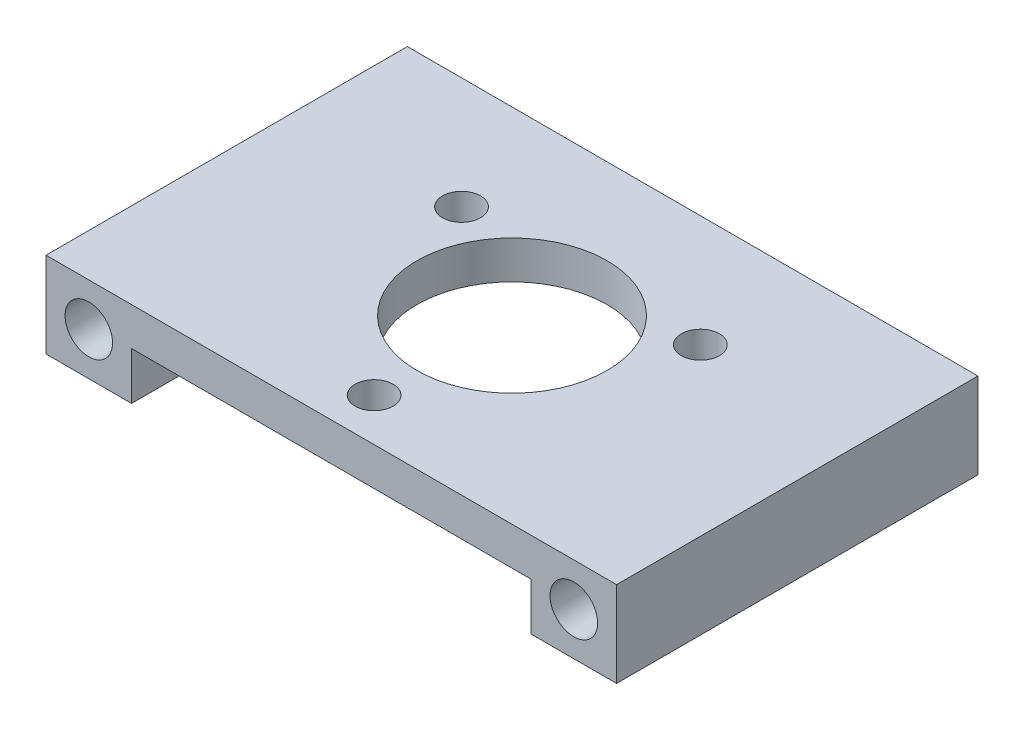
ISO-10303-21;
HEADER;
FILE_DESCRIPTION(('STEP AP214'),'2;1');
FILE_NAME('part.step','',(''),(''),'','','');
FILE_SCHEMA(('AUTOMOTIVE_DESIGN { 1 0 10303 214 1 1 1 1 }'));
ENDSEC;
DATA;
#1=APPLICATION_CONTEXT('core data for automotive mechanical design processes');
#2=APPLICATION_PROTOCOL_DEFINITION('international standard','automotive_design',2000,#1);
#3=PRODUCT_CONTEXT('',#1,'mechanical');
#4=PRODUCT('Part','Part','',(#3));
#5=PRODUCT_RELATED_PRODUCT_CATEGORY('part','',(#4));
#6=PRODUCT_DEFINITION_FORMATION('','',#4);
#7=PRODUCT_DEFINITION_CONTEXT('part definition',#1,'design');
#8=PRODUCT_DEFINITION('design','',#6,#7);
#9=PRODUCT_DEFINITION_SHAPE('','',#8);
#10=(LENGTH_UNIT() NAMED_UNIT(*) SI_UNIT(.MILLI.,.METRE.));
#11=(NAMED_UNIT(*) PLANE_ANGLE_UNIT() SI_UNIT($,.RADIAN.));
#12=(NAMED_UNIT(*) SI_UNIT($,.STERADIAN.) SOLID_ANGLE_UNIT());
#13=UNCERTAINTY_MEASURE_WITH_UNIT(LENGTH_MEASURE(1.E-05),#10,'distance_accuracy_value','');
#14=(GEOMETRIC_REPRESENTATION_CONTEXT(3) GLOBAL_UNCERTAINTY_ASSIGNED_CONTEXT((#13)) GLOBAL_UNIT_ASSIGNED_CONTEXT((#10,
#11,#12)) REPRESENTATION_CONTEXT('',''));
#15=CARTESIAN_POINT('',(0.,0.,0.));
#16=DIRECTION('',(0.,0.,1.));
#17=DIRECTION('',(1.,0.,0.));
#18=AXIS2_PLACEMENT_3D('',#15,#16,#17);
#19=CARTESIAN_POINT('',(0.,0.,38.));
#20=DIRECTION('',(0.,0.,-1.));
#21=DIRECTION('',(-1.,0.,0.));
#22=AXIS2_PLACEMENT_3D('',#19,#20,#21);
#23=PLANE('',#22);
#24=DIRECTION('',(-1.,0.,0.));
#25=VECTOR('',#24,1.);
#26=CARTESIAN_POINT('',(-30.,0.,38.));
#27=LINE('',#26,#25);
#28=CARTESIAN_POINT('',(30.,0.,38.));
#29=VERTEX_POINT('',#28);
#30=CARTESIAN_POINT('',(-30.,0.,38.));
#31=VERTEX_POINT('',#30);
#32=EDGE_CURVE('E149',#29,#31,#27,.T.);
#33=ORIENTED_EDGE('',*,*,#32,.T.);
#34=DIRECTION('',(0.,-1.,0.));
#35=VECTOR('',#34,1.);
#36=CARTESIAN_POINT('',(-30.,0.,38.));
#37=LINE('',#36,#35);
#38=CARTESIAN_POINT('',(-30.,-9.00000000000001,38.));
#39=VERTEX_POINT('',#38);
#40=EDGE_CURVE('E97',#31,#39,#37,.T.);
#41=ORIENTED_EDGE('',*,*,#40,.T.);
#42=DIRECTION('',(1.,0.,0.));
#43=VECTOR('',#42,1.);
#44=CARTESIAN_POINT('',(-30.,-9.00000000000001,38.));
#45=LINE('',#44,#43);
#46=CARTESIAN_POINT('',(-21.,-9.00000000000001,38.));
#47=VERTEX_POINT('',#46);
#48=EDGE_CURVE('E164',#39,#47,#45,.T.);
#49=ORIENTED_EDGE('',*,*,#48,.T.);
#50=DIRECTION('',(0.,1.,0.));
#51=VECTOR('',#50,1.);
#52=CARTESIAN_POINT('',(-21.,-9.00000000000001,38.));
#53=LINE('',#52,#51);
#54=CARTESIAN_POINT('',(-21.,-4.,38.));
#55=VERTEX_POINT('',#54);
#56=EDGE_CURVE('E177',#47,#55,#53,.T.);
#57=ORIENTED_EDGE('',*,*,#56,.T.);
#58=DIRECTION('',(1.,0.,0.));
#59=VECTOR('',#58,1.);
#60=CARTESIAN_POINT('',(-21.,-4.,38.));
#61=LINE('',#60,#59);
#62=CARTESIAN_POINT('',(21.,-4.,38.));
#63=VERTEX_POINT('',#62);
#64=EDGE_CURVE('E116',#55,#63,#61,.T.);
#65=ORIENTED_EDGE('',*,*,#64,.T.);
#66=DIRECTION('',(0.,-1.,0.));
#67=VECTOR('',#66,1.);
#68=CARTESIAN_POINT('',(21.,-9.,38.));
#69=LINE('',#68,#67);
#70=CARTESIAN_POINT('',(21.,-9.,38.));
#71=VERTEX_POINT('',#70);
#72=EDGE_CURVE('E110',#63,#71,#69,.T.);
#73=ORIENTED_EDGE('',*,*,#72,.T.);
#74=DIRECTION('',(1.,0.,0.));
#75=VECTOR('',#74,1.);
#76=CARTESIAN_POINT('',(30.,-9.,38.));
#77=LINE('',#76,#75);
#78=CARTESIAN_POINT('',(30.,-9.,38.));
#79=VERTEX_POINT('',#78);
#80=EDGE_CURVE('E114',#71,#79,#77,.T.);
#81=ORIENTED_EDGE('',*,*,#80,.T.);
#82=DIRECTION('',(0.,1.,0.));
#83=VECTOR('',#82,1.);
#84=CARTESIAN_POINT('',(30.,0.,38.));
#85=LINE('',#84,#83);
#86=EDGE_CURVE('E54',#79,#29,#85,.T.);
#87=ORIENTED_EDGE('',*,*,#86,.T.);
#88=EDGE_LOOP('',(#33,#41,#49,#57,#65,#73,#81,#87));
#89=FACE_BOUND('',#88,.T.);
#90=CARTESIAN_POINT('',(25.5,-4.5,38.));
#91=DIRECTION('',(0.,0.,1.));
#92=DIRECTION('',(-1.,0.,0.));
#93=AXIS2_PLACEMENT_3D('',#90,#91,#92);
#94=CIRCLE('',#93,2.5);
#95=CARTESIAN_POINT('',(23.,-4.5,38.));
#96=VERTEX_POINT('',#95);
#97=EDGE_CURVE('E138',#96,#96,#94,.T.);
#98=ORIENTED_EDGE('',*,*,#97,.F.);
#99=EDGE_LOOP('',(#98));
#100=FACE_BOUND('',#99,.T.);
#101=CARTESIAN_POINT('',(-25.5,-4.5,38.));
#102=DIRECTION('',(0.,0.,1.));
#103=DIRECTION('',(1.,0.,0.));
#104=AXIS2_PLACEMENT_3D('',#101,#102,#103);
#105=CIRCLE('',#104,2.5);
#106=CARTESIAN_POINT('',(-23.,-4.5,38.));
#107=VERTEX_POINT('',#106);
#108=EDGE_CURVE('E186',#107,#107,#105,.T.);
#109=ORIENTED_EDGE('',*,*,#108,.F.);
#110=EDGE_LOOP('',(#109));
#111=FACE_BOUND('',#110,.T.);
#112=ADVANCED_FACE('F37',(#89,#100,#111),#23,.F.);
#113=CARTESIAN_POINT('',(0.,0.,0.));
#114=DIRECTION('',(0.,0.,-1.));
#115=DIRECTION('',(-1.,0.,0.));
#116=AXIS2_PLACEMENT_3D('',#113,#114,#115);
#117=PLANE('',#116);
#118=CARTESIAN_POINT('',(25.5,-4.5,0.));
#119=DIRECTION('',(0.,0.,1.));
#120=DIRECTION('',(-1.,0.,0.));
#121=AXIS2_PLACEMENT_3D('',#118,#119,#120);
#122=CIRCLE('',#121,2.5);
#123=CARTESIAN_POINT('',(23.,-4.5,0.));
#124=VERTEX_POINT('',#123);
#125=EDGE_CURVE('E183',#124,#124,#122,.T.);
#126=ORIENTED_EDGE('',*,*,#125,.T.);
#127=EDGE_LOOP('',(#126));
#128=FACE_BOUND('',#127,.T.);
#129=DIRECTION('',(-1.,0.,0.));
#130=VECTOR('',#129,1.);
#131=CARTESIAN_POINT('',(-30.,0.,0.));
#132=LINE('',#131,#130);
#133=CARTESIAN_POINT('',(30.,0.,0.));
#134=VERTEX_POINT('',#133);
#135=CARTESIAN_POINT('',(-30.,0.,0.));
#136=VERTEX_POINT('',#135);
#137=EDGE_CURVE('E134',#134,#136,#132,.T.);
#138=ORIENTED_EDGE('',*,*,#137,.F.);
#139=DIRECTION('',(0.,1.,0.));
#140=VECTOR('',#139,1.);
#141=CARTESIAN_POINT('',(30.,0.,0.));
#142=LINE('',#141,#140);
#143=CARTESIAN_POINT('',(30.,-9.,0.));
#144=VERTEX_POINT('',#143);
#145=EDGE_CURVE('E89',#144,#134,#142,.T.);
#146=ORIENTED_EDGE('',*,*,#145,.F.);
#147=DIRECTION('',(1.,0.,0.));
#148=VECTOR('',#147,1.);
#149=CARTESIAN_POINT('',(30.,-9.,0.));
#150=LINE('',#149,#148);
#151=CARTESIAN_POINT('',(21.,-9.,0.));
#152=VERTEX_POINT('',#151);
#153=EDGE_CURVE('E83',#152,#144,#150,.T.);
#154=ORIENTED_EDGE('',*,*,#153,.F.);
#155=DIRECTION('',(0.,-1.,0.));
#156=VECTOR('',#155,1.);
#157=CARTESIAN_POINT('',(21.,-9.,0.));
#158=LINE('',#157,#156);
#159=CARTESIAN_POINT('',(21.,-4.,0.));
#160=VERTEX_POINT('',#159);
#161=EDGE_CURVE('E124',#160,#152,#158,.T.);
#162=ORIENTED_EDGE('',*,*,#161,.F.);
#163=DIRECTION('',(1.,0.,0.));
#164=VECTOR('',#163,1.);
#165=CARTESIAN_POINT('',(-21.,-4.,0.));
#166=LINE('',#165,#164);
#167=CARTESIAN_POINT('',(-21.,-4.,0.));
#168=VERTEX_POINT('',#167);
#169=EDGE_CURVE('E144',#168,#160,#166,.T.);
#170=ORIENTED_EDGE('',*,*,#169,.F.);
#171=DIRECTION('',(0.,1.,0.));
#172=VECTOR('',#171,1.);
#173=CARTESIAN_POINT('',(-21.,-9.00000000000001,0.));
#174=LINE('',#173,#172);
#175=CARTESIAN_POINT('',(-21.,-9.00000000000001,0.));
#176=VERTEX_POINT('',#175);
#177=EDGE_CURVE('E142',#176,#168,#174,.T.);
#178=ORIENTED_EDGE('',*,*,#177,.F.);
#179=DIRECTION('',(1.,0.,0.));
#180=VECTOR('',#179,1.);
#181=CARTESIAN_POINT('',(-30.,-9.00000000000001,0.));
#182=LINE('',#181,#180);
#183=CARTESIAN_POINT('',(-30.,-9.00000000000001,0.));
#184=VERTEX_POINT('',#183);
#185=EDGE_CURVE('E140',#184,#176,#182,.T.);
#186=ORIENTED_EDGE('',*,*,#185,.F.);
#187=DIRECTION('',(0.,-1.,0.));
#188=VECTOR('',#187,1.);
#189=CARTESIAN_POINT('',(-30.,0.,0.));
#190=LINE('',#189,#188);
#191=EDGE_CURVE('E137',#136,#184,#190,.T.);
#192=ORIENTED_EDGE('',*,*,#191,.F.);
#193=EDGE_LOOP('',(#138,#146,#154,#162,#170,#178,#186,#192));
#194=FACE_BOUND('',#193,.T.);
#195=CARTESIAN_POINT('',(-25.5,-4.5,0.));
#196=DIRECTION('',(0.,0.,1.));
#197=DIRECTION('',(1.,0.,0.));
#198=AXIS2_PLACEMENT_3D('',#195,#196,#197);
#199=CIRCLE('',#198,2.5);
#200=CARTESIAN_POINT('',(-23.,-4.5,0.));
#201=VERTEX_POINT('',#200);
#202=EDGE_CURVE('E189',#201,#201,#199,.T.);
#203=ORIENTED_EDGE('',*,*,#202,.T.);
#204=EDGE_LOOP('',(#203));
#205=FACE_BOUND('',#204,.T.);
#206=ADVANCED_FACE('F168',(#128,#194,#205),#117,.T.);
#207=CARTESIAN_POINT('',(-30.,0.,38.));
#208=DIRECTION('',(0.,-1.,0.));
#209=DIRECTION('',(1.,0.,0.));
#210=AXIS2_PLACEMENT_3D('',#207,#208,#209);
#211=PLANE('',#210);
#212=CARTESIAN_POINT('',(-12.5573683548735,0.,11.7499999999996));
#213=DIRECTION('',(0.,-1.,0.));
#214=DIRECTION('',(1.,0.,0.));
#215=AXIS2_PLACEMENT_3D('',#212,#213,#214);
#216=CIRCLE('',#215,2.);
#217=CARTESIAN_POINT('',(-10.5573683548735,0.,11.7499999999996));
#218=VERTEX_POINT('',#217);
#219=EDGE_CURVE('E192',#218,#218,#216,.T.);
#220=ORIENTED_EDGE('',*,*,#219,.T.);
#221=EDGE_LOOP('',(#220));
#222=FACE_BOUND('',#221,.T.);
#223=CARTESIAN_POINT('',(12.5573683548752,0.,11.7500000000005));
#224=DIRECTION('',(0.,-1.,0.));
#225=DIRECTION('',(1.,0.,0.));
#226=AXIS2_PLACEMENT_3D('',#223,#224,#225);
#227=CIRCLE('',#226,2.);
#228=CARTESIAN_POINT('',(14.5573683548752,0.,11.7500000000005));
#229=VERTEX_POINT('',#228);
#230=EDGE_CURVE('E197',#229,#229,#227,.T.);
#231=ORIENTED_EDGE('',*,*,#230,.T.);
#232=EDGE_LOOP('',(#231));
#233=FACE_BOUND('',#232,.T.);
#234=CARTESIAN_POINT('',(0.,0.,33.5));
#235=DIRECTION('',(0.,-1.,0.));
#236=DIRECTION('',(1.,0.,0.));
#237=AXIS2_PLACEMENT_3D('',#234,#235,#236);
#238=CIRCLE('',#237,2.);
#239=CARTESIAN_POINT('',(2.,0.,33.5));
#240=VERTEX_POINT('',#239);
#241=EDGE_CURVE('E200',#240,#240,#238,.T.);
#242=ORIENTED_EDGE('',*,*,#241,.T.);
#243=EDGE_LOOP('',(#242));
#244=FACE_BOUND('',#243,.T.);
#245=CARTESIAN_POINT('',(0.,0.,19.));
#246=DIRECTION('',(0.,-1.,0.));
#247=DIRECTION('',(1.,0.,0.));
#248=AXIS2_PLACEMENT_3D('',#245,#246,#247);
#249=CIRCLE('',#248,10.);
#250=CARTESIAN_POINT('',(10.,0.,19.));
#251=VERTEX_POINT('',#250);
#252=EDGE_CURVE('E203',#251,#251,#249,.T.);
#253=ORIENTED_EDGE('',*,*,#252,.T.);
#254=EDGE_LOOP('',(#253));
#255=FACE_BOUND('',#254,.T.);
#256=ORIENTED_EDGE('',*,*,#137,.T.);
#257=DIRECTION('',(0.,0.,-1.));
#258=VECTOR('',#257,1.);
#259=CARTESIAN_POINT('',(-30.,0.,38.));
#260=LINE('',#259,#258);
#261=EDGE_CURVE('E11',#31,#136,#260,.T.);
#262=ORIENTED_EDGE('',*,*,#261,.F.);
#263=ORIENTED_EDGE('',*,*,#32,.F.);
#264=DIRECTION('',(0.,0.,-1.));
#265=VECTOR('',#264,1.);
#266=CARTESIAN_POINT('',(30.,0.,38.));
#267=LINE('',#266,#265);
#268=EDGE_CURVE('E130',#29,#134,#267,.T.);
#269=ORIENTED_EDGE('',*,*,#268,.T.);
#270=EDGE_LOOP('',(#256,#262,#263,#269));
#271=FACE_BOUND('',#270,.T.);
#272=ADVANCED_FACE('F39',(#222,#233,#244,#255,#271),#211,.F.);
#273=CARTESIAN_POINT('',(-30.,0.,38.));
#274=DIRECTION('',(1.,0.,0.));
#275=DIRECTION('',(0.,0.,-1.));
#276=AXIS2_PLACEMENT_3D('',#273,#274,#275);
#277=PLANE('',#276);
#278=ORIENTED_EDGE('',*,*,#191,.T.);
#279=DIRECTION('',(0.,0.,-1.));
#280=VECTOR('',#279,1.);
#281=CARTESIAN_POINT('',(-30.,-9.00000000000001,38.));
#282=LINE('',#281,#280);
#283=EDGE_CURVE('E46',#39,#184,#282,.T.);
#284=ORIENTED_EDGE('',*,*,#283,.F.);
#285=ORIENTED_EDGE('',*,*,#40,.F.);
#286=ORIENTED_EDGE('',*,*,#261,.T.);
#287=EDGE_LOOP('',(#278,#284,#285,#286));
#288=FACE_BOUND('',#287,.T.);
#289=ADVANCED_FACE('F237',(#288),#277,.F.);
#290=CARTESIAN_POINT('',(-30.,-9.00000000000001,38.));
#291=DIRECTION('',(0.,1.,0.));
#292=DIRECTION('',(0.,0.,1.));
#293=AXIS2_PLACEMENT_3D('',#290,#291,#292);
#294=PLANE('',#293);
#295=ORIENTED_EDGE('',*,*,#185,.T.);
#296=DIRECTION('',(0.,0.,-1.));
#297=VECTOR('',#296,1.);
#298=CARTESIAN_POINT('',(-21.,-9.00000000000001,38.));
#299=LINE('',#298,#297);
#300=EDGE_CURVE('E156',#47,#176,#299,.T.);
#301=ORIENTED_EDGE('',*,*,#300,.F.);
#302=ORIENTED_EDGE('',*,*,#48,.F.);
#303=ORIENTED_EDGE('',*,*,#283,.T.);
#304=EDGE_LOOP('',(#295,#301,#302,#303));
#305=FACE_BOUND('',#304,.T.);
#306=ADVANCED_FACE('F162',(#305),#294,.F.);
#307=CARTESIAN_POINT('',(-21.,-9.00000000000001,38.));
#308=DIRECTION('',(-1.,0.,0.));
#309=DIRECTION('',(0.,0.,1.));
#310=AXIS2_PLACEMENT_3D('',#307,#308,#309);
#311=PLANE('',#310);
#312=ORIENTED_EDGE('',*,*,#177,.T.);
#313=DIRECTION('',(0.,0.,-1.));
#314=VECTOR('',#313,1.);
#315=CARTESIAN_POINT('',(-21.,-4.,38.));
#316=LINE('',#315,#314);
#317=EDGE_CURVE('E153',#55,#168,#316,.T.);
#318=ORIENTED_EDGE('',*,*,#317,.F.);
#319=ORIENTED_EDGE('',*,*,#56,.F.);
#320=ORIENTED_EDGE('',*,*,#300,.T.);
#321=EDGE_LOOP('',(#312,#318,#319,#320));
#322=FACE_BOUND('',#321,.T.);
#323=ADVANCED_FACE('F173',(#322),#311,.F.);
#324=CARTESIAN_POINT('',(-21.,-4.,38.));
#325=DIRECTION('',(0.,1.,0.));
#326=DIRECTION('',(0.,0.,1.));
#327=AXIS2_PLACEMENT_3D('',#324,#325,#326);
#328=PLANE('',#327);
#329=CARTESIAN_POINT('',(-12.5573683548735,-4.,11.7499999999996));
#330=DIRECTION('',(0.,-1.,0.));
#331=DIRECTION('',(1.,0.,0.));
#332=AXIS2_PLACEMENT_3D('',#329,#330,#331);
#333=CIRCLE('',#332,2.);
#334=CARTESIAN_POINT('',(-10.5573683548735,-4.,11.7499999999996));
#335=VERTEX_POINT('',#334);
#336=EDGE_CURVE('E210',#335,#335,#333,.T.);
#337=ORIENTED_EDGE('',*,*,#336,.F.);
#338=EDGE_LOOP('',(#337));
#339=FACE_BOUND('',#338,.T.);
#340=CARTESIAN_POINT('',(12.5573683548752,-4.,11.7500000000005));
#341=DIRECTION('',(0.,-1.,0.));
#342=DIRECTION('',(1.,0.,0.));
#343=AXIS2_PLACEMENT_3D('',#340,#341,#342);
#344=CIRCLE('',#343,2.);
#345=CARTESIAN_POINT('',(14.5573683548752,-4.,11.7500000000005));
#346=VERTEX_POINT('',#345);
#347=EDGE_CURVE('E213',#346,#346,#344,.T.);
#348=ORIENTED_EDGE('',*,*,#347,.F.);
#349=EDGE_LOOP('',(#348));
#350=FACE_BOUND('',#349,.T.);
#351=CARTESIAN_POINT('',(0.,-4.,33.5));
#352=DIRECTION('',(0.,-1.,0.));
#353=DIRECTION('',(1.,0.,0.));
#354=AXIS2_PLACEMENT_3D('',#351,#352,#353);
#355=CIRCLE('',#354,2.);
#356=CARTESIAN_POINT('',(2.,-4.,33.5));
#357=VERTEX_POINT('',#356);
#358=EDGE_CURVE('E209',#357,#357,#355,.T.);
#359=ORIENTED_EDGE('',*,*,#358,.F.);
#360=EDGE_LOOP('',(#359));
#361=FACE_BOUND('',#360,.T.);
#362=CARTESIAN_POINT('',(0.,-4.,19.));
#363=DIRECTION('',(0.,-1.,0.));
#364=DIRECTION('',(1.,0.,0.));
#365=AXIS2_PLACEMENT_3D('',#362,#363,#364);
#366=CIRCLE('',#365,10.);
#367=CARTESIAN_POINT('',(10.,-4.,19.));
#368=VERTEX_POINT('',#367);
#369=EDGE_CURVE('E206',#368,#368,#366,.T.);
#370=ORIENTED_EDGE('',*,*,#369,.F.);
#371=EDGE_LOOP('',(#370));
#372=FACE_BOUND('',#371,.T.);
#373=ORIENTED_EDGE('',*,*,#169,.T.);
#374=DIRECTION('',(0.,0.,-1.));
#375=VECTOR('',#374,1.);
#376=CARTESIAN_POINT('',(21.,-4.,38.));
#377=LINE('',#376,#375);
#378=EDGE_CURVE('E125',#63,#160,#377,.T.);
#379=ORIENTED_EDGE('',*,*,#378,.F.);
#380=ORIENTED_EDGE('',*,*,#64,.F.);
#381=ORIENTED_EDGE('',*,*,#317,.T.);
#382=EDGE_LOOP('',(#373,#379,#380,#381));
#383=FACE_BOUND('',#382,.T.);
#384=ADVANCED_FACE('F176',(#339,#350,#361,#372,#383),#328,.F.);
#385=CARTESIAN_POINT('',(21.,-9.,38.));
#386=DIRECTION('',(1.,0.,0.));
#387=DIRECTION('',(0.,1.,0.));
#388=AXIS2_PLACEMENT_3D('',#385,#386,#387);
#389=PLANE('',#388);
#390=ORIENTED_EDGE('',*,*,#161,.T.);
#391=DIRECTION('',(0.,0.,-1.));
#392=VECTOR('',#391,1.);
#393=CARTESIAN_POINT('',(21.,-9.,38.));
#394=LINE('',#393,#392);
#395=EDGE_CURVE('E121',#71,#152,#394,.T.);
#396=ORIENTED_EDGE('',*,*,#395,.F.);
#397=ORIENTED_EDGE('',*,*,#72,.F.);
#398=ORIENTED_EDGE('',*,*,#378,.T.);
#399=EDGE_LOOP('',(#390,#396,#397,#398));
#400=FACE_BOUND('',#399,.T.);
#401=ADVANCED_FACE('F122',(#400),#389,.F.);
#402=CARTESIAN_POINT('',(30.,-9.,38.));
#403=DIRECTION('',(0.,1.,0.));
#404=DIRECTION('',(0.,0.,1.));
#405=AXIS2_PLACEMENT_3D('',#402,#403,#404);
#406=PLANE('',#405);
#407=ORIENTED_EDGE('',*,*,#153,.T.);
#408=DIRECTION('',(0.,0.,-1.));
#409=VECTOR('',#408,1.);
#410=CARTESIAN_POINT('',(30.,-9.,38.));
#411=LINE('',#410,#409);
#412=EDGE_CURVE('E126',#79,#144,#411,.T.);
#413=ORIENTED_EDGE('',*,*,#412,.F.);
#414=ORIENTED_EDGE('',*,*,#80,.F.);
#415=ORIENTED_EDGE('',*,*,#395,.T.);
#416=EDGE_LOOP('',(#407,#413,#414,#415));
#417=FACE_BOUND('',#416,.T.);
#418=ADVANCED_FACE('F128',(#417),#406,.F.);
#419=CARTESIAN_POINT('',(30.,0.,38.));
#420=DIRECTION('',(-1.,0.,0.));
#421=DIRECTION('',(0.,0.,1.));
#422=AXIS2_PLACEMENT_3D('',#419,#420,#421);
#423=PLANE('',#422);
#424=ORIENTED_EDGE('',*,*,#145,.T.);
#425=ORIENTED_EDGE('',*,*,#268,.F.);
#426=ORIENTED_EDGE('',*,*,#86,.F.);
#427=ORIENTED_EDGE('',*,*,#412,.T.);
#428=EDGE_LOOP('',(#424,#425,#426,#427));
#429=FACE_BOUND('',#428,.T.);
#430=ADVANCED_FACE('F241',(#429),#423,.F.);
#431=CARTESIAN_POINT('',(25.5,-4.5,38.));
#432=DIRECTION('',(0.,0.,-1.));
#433=DIRECTION('',(-1.,0.,0.));
#434=AXIS2_PLACEMENT_3D('',#431,#432,#433);
#435=CYLINDRICAL_SURFACE('',#434,2.5);
#436=ORIENTED_EDGE('',*,*,#97,.T.);
#437=EDGE_LOOP('',(#436));
#438=FACE_BOUND('',#437,.T.);
#439=ORIENTED_EDGE('',*,*,#125,.F.);
#440=EDGE_LOOP('',(#439));
#441=FACE_BOUND('',#440,.T.);
#442=ADVANCED_FACE('F243',(#438,#441),#435,.F.);
#443=CARTESIAN_POINT('',(-25.5,-4.5,38.));
#444=DIRECTION('',(0.,0.,-1.));
#445=DIRECTION('',(-1.,0.,0.));
#446=AXIS2_PLACEMENT_3D('',#443,#444,#445);
#447=CYLINDRICAL_SURFACE('',#446,2.5);
#448=ORIENTED_EDGE('',*,*,#108,.T.);
#449=EDGE_LOOP('',(#448));
#450=FACE_BOUND('',#449,.T.);
#451=ORIENTED_EDGE('',*,*,#202,.F.);
#452=EDGE_LOOP('',(#451));
#453=FACE_BOUND('',#452,.T.);
#454=ADVANCED_FACE('F231',(#450,#453),#447,.F.);
#455=CARTESIAN_POINT('',(0.,34.,19.));
#456=DIRECTION('',(0.,-1.,0.));
#457=DIRECTION('',(1.,0.,0.));
#458=AXIS2_PLACEMENT_3D('',#455,#456,#457);
#459=CYLINDRICAL_SURFACE('',#458,10.);
#460=ORIENTED_EDGE('',*,*,#369,.T.);
#461=EDGE_LOOP('',(#460));
#462=FACE_BOUND('',#461,.T.);
#463=ORIENTED_EDGE('',*,*,#252,.F.);
#464=EDGE_LOOP('',(#463));
#465=FACE_BOUND('',#464,.T.);
#466=ADVANCED_FACE('F228',(#462,#465),#459,.F.);
#467=CARTESIAN_POINT('',(0.,34.,33.5));
#468=DIRECTION('',(0.,-1.,0.));
#469=DIRECTION('',(1.,0.,0.));
#470=AXIS2_PLACEMENT_3D('',#467,#468,#469);
#471=CYLINDRICAL_SURFACE('',#470,2.);
#472=ORIENTED_EDGE('',*,*,#358,.T.);
#473=EDGE_LOOP('',(#472));
#474=FACE_BOUND('',#473,.T.);
#475=ORIENTED_EDGE('',*,*,#241,.F.);
#476=EDGE_LOOP('',(#475));
#477=FACE_BOUND('',#476,.T.);
#478=ADVANCED_FACE('F219',(#474,#477),#471,.F.);
#479=CARTESIAN_POINT('',(12.5573683548753,34.,11.7500000000005));
#480=DIRECTION('',(0.,-1.,0.));
#481=DIRECTION('',(1.,0.,0.));
#482=AXIS2_PLACEMENT_3D('',#479,#480,#481);
#483=CYLINDRICAL_SURFACE('',#482,2.);
#484=ORIENTED_EDGE('',*,*,#347,.T.);
#485=EDGE_LOOP('',(#484));
#486=FACE_BOUND('',#485,.T.);
#487=ORIENTED_EDGE('',*,*,#230,.F.);
#488=EDGE_LOOP('',(#487));
#489=FACE_BOUND('',#488,.T.);
#490=ADVANCED_FACE('F266',(#486,#489),#483,.F.);
#491=CARTESIAN_POINT('',(-12.5573683548735,34.,11.7499999999996));
#492=DIRECTION('',(0.,-1.,0.));
#493=DIRECTION('',(1.,0.,0.));
#494=AXIS2_PLACEMENT_3D('',#491,#492,#493);
#495=CYLINDRICAL_SURFACE('',#494,2.);
#496=ORIENTED_EDGE('',*,*,#336,.T.);
#497=EDGE_LOOP('',(#496));
#498=FACE_BOUND('',#497,.T.);
#499=ORIENTED_EDGE('',*,*,#219,.F.);
#500=EDGE_LOOP('',(#499));
#501=FACE_BOUND('',#500,.T.);
#502=ADVANCED_FACE('F263',(#498,#501),#495,.F.);
#503=CLOSED_SHELL('',(#112,#206,#272,#289,#306,#323,#384,#401,#418,#430,#442,#454,#466,#478,
#490,#502));
#504=MANIFOLD_SOLID_BREP('B2',#503);
#505=ADVANCED_BREP_SHAPE_REPRESENTATION('',(#18,#504),#14);
#506=SHAPE_DEFINITION_REPRESENTATION(#9,#505);
ENDSEC;
END-ISO-10303-21;
